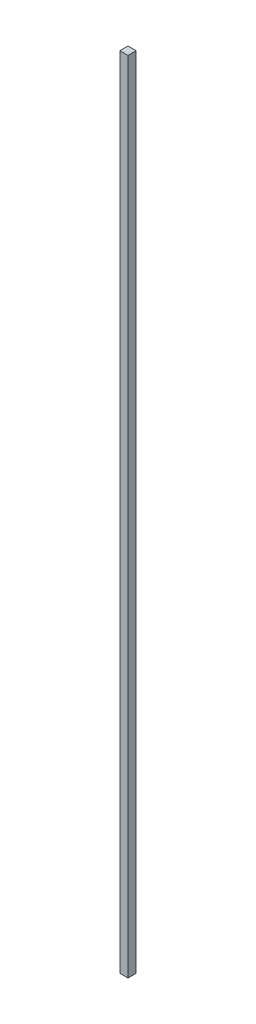
ISO-10303-21;
HEADER;
FILE_DESCRIPTION(('STEP AP214'),'2;1');
FILE_NAME('part.step','',(''),(''),'','','');
FILE_SCHEMA(('AUTOMOTIVE_DESIGN { 1 0 10303 214 1 1 1 1 }'));
ENDSEC;
DATA;
#1=APPLICATION_CONTEXT('core data for automotive mechanical design processes');
#2=APPLICATION_PROTOCOL_DEFINITION('international standard','automotive_design',2000,#1);
#3=PRODUCT_CONTEXT('',#1,'mechanical');
#4=PRODUCT('Part','Part','',(#3));
#5=PRODUCT_RELATED_PRODUCT_CATEGORY('part','',(#4));
#6=PRODUCT_DEFINITION_FORMATION('','',#4);
#7=PRODUCT_DEFINITION_CONTEXT('part definition',#1,'design');
#8=PRODUCT_DEFINITION('design','',#6,#7);
#9=PRODUCT_DEFINITION_SHAPE('','',#8);
#10=(LENGTH_UNIT() NAMED_UNIT(*) SI_UNIT(.MILLI.,.METRE.));
#11=(NAMED_UNIT(*) PLANE_ANGLE_UNIT() SI_UNIT($,.RADIAN.));
#12=(NAMED_UNIT(*) SI_UNIT($,.STERADIAN.) SOLID_ANGLE_UNIT());
#13=UNCERTAINTY_MEASURE_WITH_UNIT(LENGTH_MEASURE(1.E-05),#10,'distance_accuracy_value','');
#14=(GEOMETRIC_REPRESENTATION_CONTEXT(3) GLOBAL_UNCERTAINTY_ASSIGNED_CONTEXT((#13)) GLOBAL_UNIT_ASSIGNED_CONTEXT((#10,
#11,#12)) REPRESENTATION_CONTEXT('',''));
#15=CARTESIAN_POINT('',(0.,0.,0.));
#16=DIRECTION('',(0.,0.,1.));
#17=DIRECTION('',(1.,0.,0.));
#18=AXIS2_PLACEMENT_3D('',#15,#16,#17);
#19=CARTESIAN_POINT('',(0.,1960.,0.));
#20=DIRECTION('',(1.,0.,0.));
#21=DIRECTION('',(0.,0.,-1.));
#22=AXIS2_PLACEMENT_3D('',#19,#20,#21);
#23=PLANE('',#22);
#24=DIRECTION('',(0.,0.,1.));
#25=VECTOR('',#24,1.);
#26=CARTESIAN_POINT('',(0.,0.,0.));
#27=LINE('',#26,#25);
#28=CARTESIAN_POINT('',(0.,0.,0.));
#29=VERTEX_POINT('',#28);
#30=CARTESIAN_POINT('',(0.,0.,20.));
#31=VERTEX_POINT('',#30);
#32=EDGE_CURVE('E95',#29,#31,#27,.T.);
#33=ORIENTED_EDGE('',*,*,#32,.T.);
#34=DIRECTION('',(0.,-1.,0.));
#35=VECTOR('',#34,1.);
#36=CARTESIAN_POINT('',(0.,1960.,20.));
#37=LINE('',#36,#35);
#38=CARTESIAN_POINT('',(0.,1960.,20.));
#39=VERTEX_POINT('',#38);
#40=EDGE_CURVE('E11',#39,#31,#37,.T.);
#41=ORIENTED_EDGE('',*,*,#40,.F.);
#42=DIRECTION('',(0.,0.,1.));
#43=VECTOR('',#42,1.);
#44=CARTESIAN_POINT('',(0.,1960.,0.));
#45=LINE('',#44,#43);
#46=CARTESIAN_POINT('',(0.,1960.,0.));
#47=VERTEX_POINT('',#46);
#48=EDGE_CURVE('E83',#47,#39,#45,.T.);
#49=ORIENTED_EDGE('',*,*,#48,.F.);
#50=DIRECTION('',(0.,-1.,0.));
#51=VECTOR('',#50,1.);
#52=CARTESIAN_POINT('',(0.,1960.,0.));
#53=LINE('',#52,#51);
#54=EDGE_CURVE('E91',#47,#29,#53,.T.);
#55=ORIENTED_EDGE('',*,*,#54,.T.);
#56=EDGE_LOOP('',(#33,#41,#49,#55));
#57=FACE_BOUND('',#56,.T.);
#58=ADVANCED_FACE('F32',(#57),#23,.F.);
#59=CARTESIAN_POINT('',(0.,1960.,20.));
#60=DIRECTION('',(0.,0.,-1.));
#61=DIRECTION('',(-1.,0.,0.));
#62=AXIS2_PLACEMENT_3D('',#59,#60,#61);
#63=PLANE('',#62);
#64=DIRECTION('',(1.,0.,0.));
#65=VECTOR('',#64,1.);
#66=CARTESIAN_POINT('',(0.,0.,20.));
#67=LINE('',#66,#65);
#68=CARTESIAN_POINT('',(20.,0.,20.));
#69=VERTEX_POINT('',#68);
#70=EDGE_CURVE('E87',#31,#69,#67,.T.);
#71=ORIENTED_EDGE('',*,*,#70,.T.);
#72=DIRECTION('',(0.,-1.,0.));
#73=VECTOR('',#72,1.);
#74=CARTESIAN_POINT('',(20.,1960.,20.));
#75=LINE('',#74,#73);
#76=CARTESIAN_POINT('',(20.,1960.,20.));
#77=VERTEX_POINT('',#76);
#78=EDGE_CURVE('E40',#77,#69,#75,.T.);
#79=ORIENTED_EDGE('',*,*,#78,.F.);
#80=DIRECTION('',(1.,0.,0.));
#81=VECTOR('',#80,1.);
#82=CARTESIAN_POINT('',(0.,1960.,20.));
#83=LINE('',#82,#81);
#84=EDGE_CURVE('E78',#39,#77,#83,.T.);
#85=ORIENTED_EDGE('',*,*,#84,.F.);
#86=ORIENTED_EDGE('',*,*,#40,.T.);
#87=EDGE_LOOP('',(#71,#79,#85,#86));
#88=FACE_BOUND('',#87,.T.);
#89=ADVANCED_FACE('F86',(#88),#63,.F.);
#90=CARTESIAN_POINT('',(20.,1960.,0.));
#91=DIRECTION('',(-1.,0.,0.));
#92=DIRECTION('',(0.,0.,1.));
#93=AXIS2_PLACEMENT_3D('',#90,#91,#92);
#94=PLANE('',#93);
#95=DIRECTION('',(0.,0.,-1.));
#96=VECTOR('',#95,1.);
#97=CARTESIAN_POINT('',(20.,0.,0.));
#98=LINE('',#97,#96);
#99=CARTESIAN_POINT('',(20.,0.,0.));
#100=VERTEX_POINT('',#99);
#101=EDGE_CURVE('E65',#69,#100,#98,.T.);
#102=ORIENTED_EDGE('',*,*,#101,.T.);
#103=DIRECTION('',(0.,-1.,0.));
#104=VECTOR('',#103,1.);
#105=CARTESIAN_POINT('',(20.,1960.,0.));
#106=LINE('',#105,#104);
#107=CARTESIAN_POINT('',(20.,1960.,0.));
#108=VERTEX_POINT('',#107);
#109=EDGE_CURVE('E88',#108,#100,#106,.T.);
#110=ORIENTED_EDGE('',*,*,#109,.F.);
#111=DIRECTION('',(0.,0.,-1.));
#112=VECTOR('',#111,1.);
#113=CARTESIAN_POINT('',(20.,1960.,0.));
#114=LINE('',#113,#112);
#115=EDGE_CURVE('E81',#77,#108,#114,.T.);
#116=ORIENTED_EDGE('',*,*,#115,.F.);
#117=ORIENTED_EDGE('',*,*,#78,.T.);
#118=EDGE_LOOP('',(#102,#110,#116,#117));
#119=FACE_BOUND('',#118,.T.);
#120=ADVANCED_FACE('F89',(#119),#94,.F.);
#121=CARTESIAN_POINT('',(0.,1960.,0.));
#122=DIRECTION('',(0.,0.,1.));
#123=DIRECTION('',(1.,0.,0.));
#124=AXIS2_PLACEMENT_3D('',#121,#122,#123);
#125=PLANE('',#124);
#126=DIRECTION('',(-1.,0.,0.));
#127=VECTOR('',#126,1.);
#128=CARTESIAN_POINT('',(0.,0.,0.));
#129=LINE('',#128,#127);
#130=EDGE_CURVE('E71',#100,#29,#129,.T.);
#131=ORIENTED_EDGE('',*,*,#130,.T.);
#132=ORIENTED_EDGE('',*,*,#54,.F.);
#133=DIRECTION('',(-1.,0.,0.));
#134=VECTOR('',#133,1.);
#135=CARTESIAN_POINT('',(0.,1960.,0.));
#136=LINE('',#135,#134);
#137=EDGE_CURVE('E48',#108,#47,#136,.T.);
#138=ORIENTED_EDGE('',*,*,#137,.F.);
#139=ORIENTED_EDGE('',*,*,#109,.T.);
#140=EDGE_LOOP('',(#131,#132,#138,#139));
#141=FACE_BOUND('',#140,.T.);
#142=ADVANCED_FACE('F102',(#141),#125,.F.);
#143=CARTESIAN_POINT('',(0.,1960.,0.));
#144=DIRECTION('',(0.,1.,0.));
#145=DIRECTION('',(0.,0.,1.));
#146=AXIS2_PLACEMENT_3D('',#143,#144,#145);
#147=PLANE('',#146);
#148=ORIENTED_EDGE('',*,*,#48,.T.);
#149=ORIENTED_EDGE('',*,*,#84,.T.);
#150=ORIENTED_EDGE('',*,*,#115,.T.);
#151=ORIENTED_EDGE('',*,*,#137,.T.);
#152=EDGE_LOOP('',(#148,#149,#150,#151));
#153=FACE_BOUND('',#152,.T.);
#154=ADVANCED_FACE('F79',(#153),#147,.T.);
#155=CARTESIAN_POINT('',(0.,0.,0.));
#156=DIRECTION('',(0.,1.,0.));
#157=DIRECTION('',(0.,0.,1.));
#158=AXIS2_PLACEMENT_3D('',#155,#156,#157);
#159=PLANE('',#158);
#160=ORIENTED_EDGE('',*,*,#32,.F.);
#161=ORIENTED_EDGE('',*,*,#130,.F.);
#162=ORIENTED_EDGE('',*,*,#101,.F.);
#163=ORIENTED_EDGE('',*,*,#70,.F.);
#164=EDGE_LOOP('',(#160,#161,#162,#163));
#165=FACE_BOUND('',#164,.T.);
#166=ADVANCED_FACE('F105',(#165),#159,.F.);
#167=CLOSED_SHELL('',(#58,#89,#120,#142,#154,#166));
#168=MANIFOLD_SOLID_BREP('B2',#167);
#169=ADVANCED_BREP_SHAPE_REPRESENTATION('',(#18,#168),#14);
#170=SHAPE_DEFINITION_REPRESENTATION(#9,#169);
ENDSEC;
END-ISO-10303-21;
